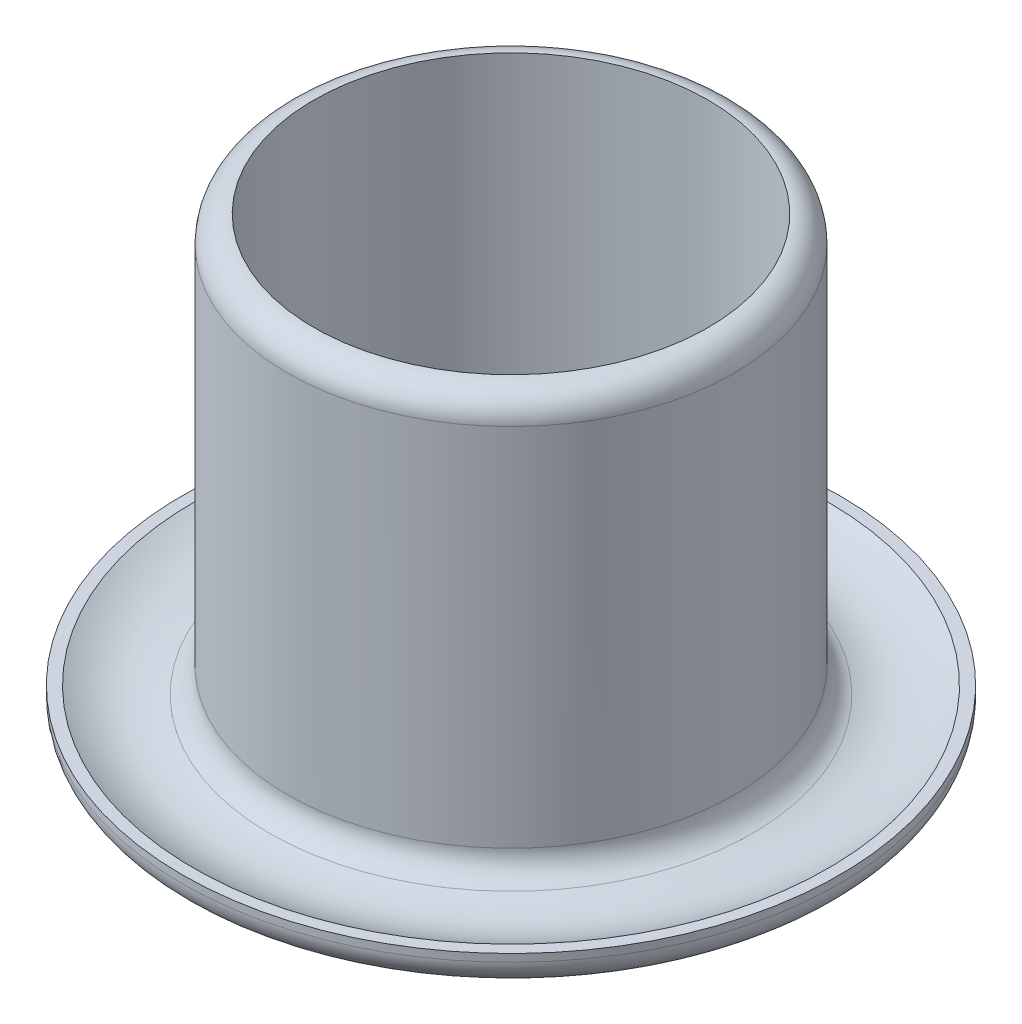
ISO-10303-21;
HEADER;
FILE_DESCRIPTION(('STEP AP214'),'2;1');
FILE_NAME('part.step','',(''),(''),'','','');
FILE_SCHEMA(('AUTOMOTIVE_DESIGN { 1 0 10303 214 1 1 1 1 }'));
ENDSEC;
DATA;
#1=APPLICATION_CONTEXT('core data for automotive mechanical design processes');
#2=APPLICATION_PROTOCOL_DEFINITION('international standard','automotive_design',2000,#1);
#3=PRODUCT_CONTEXT('',#1,'mechanical');
#4=PRODUCT('Part','Part','',(#3));
#5=PRODUCT_RELATED_PRODUCT_CATEGORY('part','',(#4));
#6=PRODUCT_DEFINITION_FORMATION('','',#4);
#7=PRODUCT_DEFINITION_CONTEXT('part definition',#1,'design');
#8=PRODUCT_DEFINITION('design','',#6,#7);
#9=PRODUCT_DEFINITION_SHAPE('','',#8);
#10=(LENGTH_UNIT() NAMED_UNIT(*) SI_UNIT(.MILLI.,.METRE.));
#11=(NAMED_UNIT(*) PLANE_ANGLE_UNIT() SI_UNIT($,.RADIAN.));
#12=(NAMED_UNIT(*) SI_UNIT($,.STERADIAN.) SOLID_ANGLE_UNIT());
#13=UNCERTAINTY_MEASURE_WITH_UNIT(LENGTH_MEASURE(1.E-05),#10,'distance_accuracy_value','');
#14=(GEOMETRIC_REPRESENTATION_CONTEXT(3) GLOBAL_UNCERTAINTY_ASSIGNED_CONTEXT((#13)) GLOBAL_UNIT_ASSIGNED_CONTEXT((#10,
#11,#12)) REPRESENTATION_CONTEXT('',''));
#15=CARTESIAN_POINT('',(0.,0.,0.));
#16=DIRECTION('',(0.,0.,1.));
#17=DIRECTION('',(1.,0.,0.));
#18=AXIS2_PLACEMENT_3D('',#15,#16,#17);
#19=CARTESIAN_POINT('',(1.5,0.,0.));
#20=CARTESIAN_POINT('',(2.00398015027617,-0.201922676621396,0.));
#21=CARTESIAN_POINT('',(2.5,0.,0.));
#22=B_SPLINE_CURVE_WITH_KNOTS('',2,(#19,#20,#21),.UNSPECIFIED.,.F.,.F.,(3,3),(0.,1.),.UNSPECIFIED.);
#23=CARTESIAN_POINT('',(0.,0.,0.));
#24=DIRECTION('',(0.,-1.,0.));
#25=AXIS1_PLACEMENT('',#23,#24);
#26=SURFACE_OF_REVOLUTION('',#22,#25);
#27=CARTESIAN_POINT('',(0.,-0.0502598946427437,0.));
#28=DIRECTION('',(0.,-1.,0.));
#29=DIRECTION('',(0.,0.,-1.));
#30=AXIS2_PLACEMENT_3D('',#27,#28,#29);
#31=CIRCLE('',#30,2.35531635640152);
#32=CARTESIAN_POINT('',(0.,-0.0502598946427437,-2.35531635640152));
#33=VERTEX_POINT('',#32);
#34=EDGE_CURVE('E56',#33,#33,#31,.T.);
#35=ORIENTED_EDGE('',*,*,#34,.T.);
#36=EDGE_LOOP('',(#35));
#37=FACE_BOUND('',#36,.T.);
#38=CARTESIAN_POINT('',(0.,-0.0497923930310015,0.));
#39=DIRECTION('',(0.,-1.,0.));
#40=DIRECTION('',(0.,0.,-1.));
#41=AXIS2_PLACEMENT_3D('',#38,#39,#40);
#42=CIRCLE('',#41,1.64502598737938);
#43=CARTESIAN_POINT('',(0.,-0.0497923930310015,-1.64502598737938));
#44=VERTEX_POINT('',#43);
#45=EDGE_CURVE('E59',#44,#44,#42,.F.);
#46=ORIENTED_EDGE('',*,*,#45,.T.);
#47=EDGE_LOOP('',(#46));
#48=FACE_BOUND('',#47,.T.);
#49=ADVANCED_FACE('F33',(#37,#48),#26,.F.);
#50=CARTESIAN_POINT('',(0.,0.,0.));
#51=DIRECTION('',(0.,-1.,0.));
#52=DIRECTION('',(0.,0.,-1.));
#53=AXIS2_PLACEMENT_3D('',#50,#51,#52);
#54=CYLINDRICAL_SURFACE('',#53,1.5);
#55=CARTESIAN_POINT('',(0.,0.142503883418616,0.));
#56=DIRECTION('',(0.,1.,0.));
#57=DIRECTION('',(0.,0.,1.));
#58=AXIS2_PLACEMENT_3D('',#55,#56,#57);
#59=CIRCLE('',#58,1.5);
#60=CARTESIAN_POINT('',(0.,0.142503883418616,1.5));
#61=VERTEX_POINT('',#60);
#62=EDGE_CURVE('E48',#61,#61,#59,.F.);
#63=ORIENTED_EDGE('',*,*,#62,.T.);
#64=EDGE_LOOP('',(#63));
#65=FACE_BOUND('',#64,.T.);
#66=CARTESIAN_POINT('',(0.,3.30643976489813,0.));
#67=DIRECTION('',(0.,-1.,0.));
#68=DIRECTION('',(0.,0.,-1.));
#69=AXIS2_PLACEMENT_3D('',#66,#67,#68);
#70=CIRCLE('',#69,1.5);
#71=CARTESIAN_POINT('',(0.,3.30643976489813,-1.5));
#72=VERTEX_POINT('',#71);
#73=EDGE_CURVE('E62',#72,#72,#70,.T.);
#74=ORIENTED_EDGE('',*,*,#73,.F.);
#75=EDGE_LOOP('',(#74));
#76=FACE_BOUND('',#75,.T.);
#77=ADVANCED_FACE('F92',(#65,#76),#54,.F.);
#78=CARTESIAN_POINT('',(0.,0.,0.));
#79=DIRECTION('',(0.,-1.,0.));
#80=DIRECTION('',(0.,0.,-1.));
#81=AXIS2_PLACEMENT_3D('',#78,#79,#80);
#82=CYLINDRICAL_SURFACE('',#81,1.7);
#83=CARTESIAN_POINT('',(0.,0.327648588937909,0.));
#84=DIRECTION('',(0.,-1.,0.));
#85=DIRECTION('',(0.,0.,-1.));
#86=AXIS2_PLACEMENT_3D('',#83,#84,#85);
#87=CIRCLE('',#86,1.7);
#88=CARTESIAN_POINT('',(0.,0.327648588937909,-1.7));
#89=VERTEX_POINT('',#88);
#90=EDGE_CURVE('E10',#89,#89,#87,.F.);
#91=ORIENTED_EDGE('',*,*,#90,.T.);
#92=EDGE_LOOP('',(#91));
#93=FACE_BOUND('',#92,.T.);
#94=CARTESIAN_POINT('',(0.,3.10643976489813,0.));
#95=DIRECTION('',(0.,1.,0.));
#96=DIRECTION('',(0.,0.,1.));
#97=AXIS2_PLACEMENT_3D('',#94,#95,#96);
#98=CIRCLE('',#97,1.7);
#99=CARTESIAN_POINT('',(0.,3.10643976489813,1.7));
#100=VERTEX_POINT('',#99);
#101=EDGE_CURVE('E40',#100,#100,#98,.F.);
#102=ORIENTED_EDGE('',*,*,#101,.T.);
#103=EDGE_LOOP('',(#102));
#104=FACE_BOUND('',#103,.T.);
#105=ADVANCED_FACE('F87',(#93,#104),#82,.T.);
#106=CARTESIAN_POINT('',(2.4130455665446,0.2,0.));
#107=CARTESIAN_POINT('',(2.05568194967429,-4.49010893688704E-05,0.));
#108=CARTESIAN_POINT('',(1.7,0.2,0.));
#109=B_SPLINE_CURVE_WITH_KNOTS('',2,(#106,#107,#108),.UNSPECIFIED.,.F.,.F.,(3,3),(0.,1.),.UNSPECIFIED.);
#110=CARTESIAN_POINT('',(0.,0.,0.));
#111=DIRECTION('',(0.,-1.,0.));
#112=AXIS1_PLACEMENT('',#110,#111);
#113=SURFACE_OF_REVOLUTION('',#109,#112);
#114=CARTESIAN_POINT('',(0.,0.138911443478199,0.));
#115=DIRECTION('',(0.,-1.,0.));
#116=DIRECTION('',(0.,0.,-1.));
#117=AXIS2_PLACEMENT_3D('',#114,#115,#116);
#118=CIRCLE('',#117,1.83383135241128);
#119=CARTESIAN_POINT('',(0.,0.138911443478199,-1.83383135241128));
#120=VERTEX_POINT('',#119);
#121=EDGE_CURVE('E44',#120,#120,#118,.T.);
#122=ORIENTED_EDGE('',*,*,#121,.T.);
#123=EDGE_LOOP('',(#122));
#124=FACE_BOUND('',#123,.T.);
#125=CARTESIAN_POINT('',(0.,0.2,0.));
#126=DIRECTION('',(0.,-1.,0.));
#127=DIRECTION('',(0.,0.,-1.));
#128=AXIS2_PLACEMENT_3D('',#125,#126,#127);
#129=CIRCLE('',#128,2.4130455665446);
#130=CARTESIAN_POINT('',(0.,0.2,-2.4130455665446));
#131=VERTEX_POINT('',#130);
#132=EDGE_CURVE('E65',#131,#131,#129,.T.);
#133=ORIENTED_EDGE('',*,*,#132,.F.);
#134=EDGE_LOOP('',(#133));
#135=FACE_BOUND('',#134,.T.);
#136=ADVANCED_FACE('F82',(#124,#135),#113,.F.);
#137=CARTESIAN_POINT('',(2.5,0.2,0.));
#138=DIRECTION('',(0.,1.,0.));
#139=DIRECTION('',(0.,0.,1.));
#140=AXIS2_PLACEMENT_3D('',#137,#138,#139);
#141=PLANE('',#140);
#142=ORIENTED_EDGE('',*,*,#132,.T.);
#143=EDGE_LOOP('',(#142));
#144=FACE_BOUND('',#143,.T.);
#145=CARTESIAN_POINT('',(0.,0.2,0.));
#146=DIRECTION('',(0.,-1.,0.));
#147=DIRECTION('',(0.,0.,-1.));
#148=AXIS2_PLACEMENT_3D('',#145,#146,#147);
#149=CIRCLE('',#148,2.5);
#150=CARTESIAN_POINT('',(0.,0.2,-2.5));
#151=VERTEX_POINT('',#150);
#152=EDGE_CURVE('E68',#151,#151,#149,.T.);
#153=ORIENTED_EDGE('',*,*,#152,.F.);
#154=EDGE_LOOP('',(#153));
#155=FACE_BOUND('',#154,.T.);
#156=ADVANCED_FACE('F86',(#144,#155),#141,.T.);
#157=CARTESIAN_POINT('',(0.,0.,0.));
#158=DIRECTION('',(0.,-1.,0.));
#159=DIRECTION('',(0.,0.,-1.));
#160=AXIS2_PLACEMENT_3D('',#157,#158,#159);
#161=CYLINDRICAL_SURFACE('',#160,2.5);
#162=CARTESIAN_POINT('',(0.,0.141938182128226,0.));
#163=DIRECTION('',(0.,1.,0.));
#164=DIRECTION('',(0.,0.,1.));
#165=AXIS2_PLACEMENT_3D('',#162,#163,#164);
#166=CIRCLE('',#165,2.5);
#167=CARTESIAN_POINT('',(0.,0.141938182128226,2.5));
#168=VERTEX_POINT('',#167);
#169=EDGE_CURVE('E53',#168,#168,#166,.T.);
#170=ORIENTED_EDGE('',*,*,#169,.T.);
#171=EDGE_LOOP('',(#170));
#172=FACE_BOUND('',#171,.T.);
#173=ORIENTED_EDGE('',*,*,#152,.T.);
#174=EDGE_LOOP('',(#173));
#175=FACE_BOUND('',#174,.T.);
#176=ADVANCED_FACE('F103',(#172,#175),#161,.T.);
#177=CARTESIAN_POINT('',(0.,0.141938182128226,0.));
#178=DIRECTION('',(0.,1.,0.));
#179=DIRECTION('',(0.,0.,1.));
#180=AXIS2_PLACEMENT_3D('',#177,#178,#179);
#181=TOROIDAL_SURFACE('',#180,2.3,0.2);
#182=ORIENTED_EDGE('',*,*,#169,.F.);
#183=EDGE_LOOP('',(#182));
#184=FACE_BOUND('',#183,.T.);
#185=ORIENTED_EDGE('',*,*,#34,.F.);
#186=EDGE_LOOP('',(#185));
#187=FACE_BOUND('',#186,.T.);
#188=ADVANCED_FACE('F99',(#184,#187),#181,.T.);
#189=CARTESIAN_POINT('',(0.,0.142503883418616,0.));
#190=DIRECTION('',(0.,1.,0.));
#191=DIRECTION('',(0.,0.,1.));
#192=AXIS2_PLACEMENT_3D('',#189,#190,#191);
#193=TOROIDAL_SURFACE('',#192,1.7,0.2);
#194=ORIENTED_EDGE('',*,*,#45,.F.);
#195=EDGE_LOOP('',(#194));
#196=FACE_BOUND('',#195,.T.);
#197=ORIENTED_EDGE('',*,*,#62,.F.);
#198=EDGE_LOOP('',(#197));
#199=FACE_BOUND('',#198,.T.);
#200=ADVANCED_FACE('F102',(#196,#199),#193,.T.);
#201=CARTESIAN_POINT('',(0.,0.327648588937909,0.));
#202=DIRECTION('',(0.,-1.,0.));
#203=DIRECTION('',(0.,0.,-1.));
#204=AXIS2_PLACEMENT_3D('',#201,#202,#203);
#205=TOROIDAL_SURFACE('',#204,1.9,0.2);
#206=ORIENTED_EDGE('',*,*,#90,.F.);
#207=EDGE_LOOP('',(#206));
#208=FACE_BOUND('',#207,.T.);
#209=ORIENTED_EDGE('',*,*,#121,.F.);
#210=EDGE_LOOP('',(#209));
#211=FACE_BOUND('',#210,.T.);
#212=ADVANCED_FACE('F106',(#208,#211),#205,.F.);
#213=CARTESIAN_POINT('',(0.,3.10643976489813,0.));
#214=DIRECTION('',(0.,1.,0.));
#215=DIRECTION('',(0.,0.,1.));
#216=AXIS2_PLACEMENT_3D('',#213,#214,#215);
#217=TOROIDAL_SURFACE('',#216,1.5,0.2);
#218=ORIENTED_EDGE('',*,*,#73,.T.);
#219=EDGE_LOOP('',(#218));
#220=FACE_BOUND('',#219,.T.);
#221=ORIENTED_EDGE('',*,*,#101,.F.);
#222=EDGE_LOOP('',(#221));
#223=FACE_BOUND('',#222,.T.);
#224=ADVANCED_FACE('F35',(#220,#223),#217,.T.);
#225=CLOSED_SHELL('',(#49,#77,#105,#136,#156,#176,#188,#200,#212,#224));
#226=MANIFOLD_SOLID_BREP('B2',#225);
#227=ADVANCED_BREP_SHAPE_REPRESENTATION('',(#18,#226),#14);
#228=SHAPE_DEFINITION_REPRESENTATION(#9,#227);
ENDSEC;
END-ISO-10303-21;
